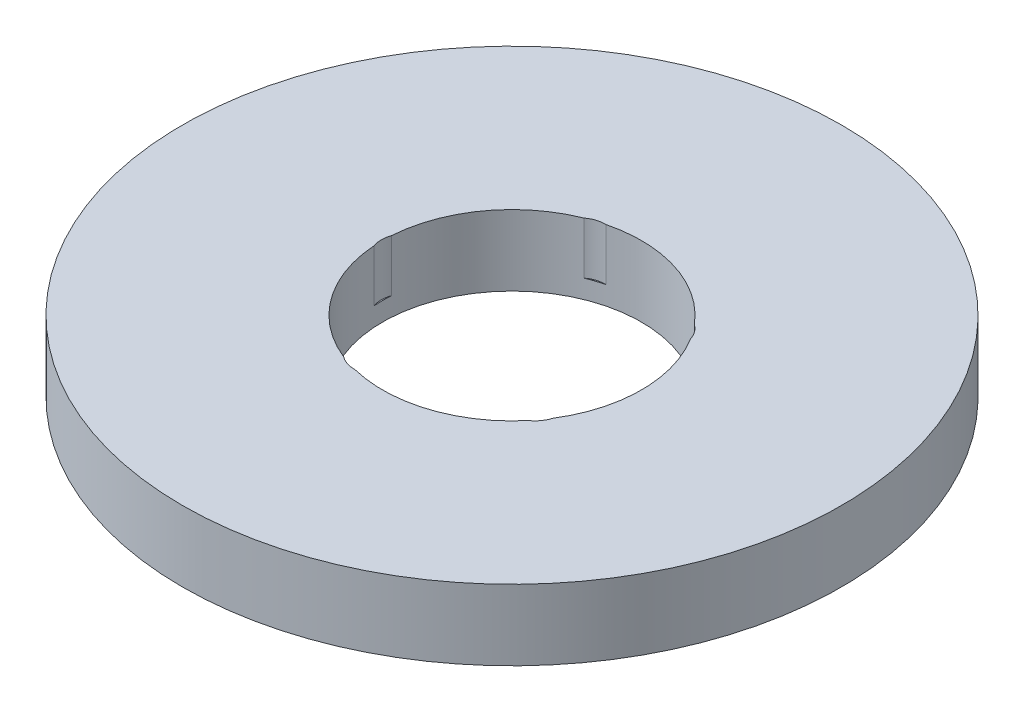
ISO-10303-21;
HEADER;
FILE_DESCRIPTION(('STEP AP214'),'2;1');
FILE_NAME('part.step','',(''),(''),'','','');
FILE_SCHEMA(('AUTOMOTIVE_DESIGN { 1 0 10303 214 1 1 1 1 }'));
ENDSEC;
DATA;
#1=APPLICATION_CONTEXT('core data for automotive mechanical design processes');
#2=APPLICATION_PROTOCOL_DEFINITION('international standard','automotive_design',2000,#1);
#3=PRODUCT_CONTEXT('',#1,'mechanical');
#4=PRODUCT('Part','Part','',(#3));
#5=PRODUCT_RELATED_PRODUCT_CATEGORY('part','',(#4));
#6=PRODUCT_DEFINITION_FORMATION('','',#4);
#7=PRODUCT_DEFINITION_CONTEXT('part definition',#1,'design');
#8=PRODUCT_DEFINITION('design','',#6,#7);
#9=PRODUCT_DEFINITION_SHAPE('','',#8);
#10=(LENGTH_UNIT() NAMED_UNIT(*) SI_UNIT(.MILLI.,.METRE.));
#11=(NAMED_UNIT(*) PLANE_ANGLE_UNIT() SI_UNIT($,.RADIAN.));
#12=(NAMED_UNIT(*) SI_UNIT($,.STERADIAN.) SOLID_ANGLE_UNIT());
#13=UNCERTAINTY_MEASURE_WITH_UNIT(LENGTH_MEASURE(1.E-05),#10,'distance_accuracy_value','');
#14=(GEOMETRIC_REPRESENTATION_CONTEXT(3) GLOBAL_UNCERTAINTY_ASSIGNED_CONTEXT((#13)) GLOBAL_UNIT_ASSIGNED_CONTEXT((#10,
#11,#12)) REPRESENTATION_CONTEXT('',''));
#15=CARTESIAN_POINT('',(0.,0.,0.));
#16=DIRECTION('',(0.,0.,1.));
#17=DIRECTION('',(1.,0.,0.));
#18=AXIS2_PLACEMENT_3D('',#15,#16,#17);
#19=CARTESIAN_POINT('',(0.,15.,0.));
#20=DIRECTION('',(0.,-1.,0.));
#21=DIRECTION('',(0.,0.,-1.));
#22=AXIS2_PLACEMENT_3D('',#19,#20,#21);
#23=CYLINDRICAL_SURFACE('',#22,70.);
#24=CARTESIAN_POINT('',(0.,15.,0.));
#25=DIRECTION('',(0.,1.,0.));
#26=DIRECTION('',(0.,0.,1.));
#27=AXIS2_PLACEMENT_3D('',#24,#25,#26);
#28=CIRCLE('',#27,70.);
#29=CARTESIAN_POINT('',(0.,15.,70.));
#30=VERTEX_POINT('',#29);
#31=EDGE_CURVE('E151',#30,#30,#28,.T.);
#32=ORIENTED_EDGE('',*,*,#31,.F.);
#33=EDGE_LOOP('',(#32));
#34=FACE_BOUND('',#33,.T.);
#35=CARTESIAN_POINT('',(0.,0.,0.));
#36=DIRECTION('',(0.,1.,0.));
#37=DIRECTION('',(0.,0.,1.));
#38=AXIS2_PLACEMENT_3D('',#35,#36,#37);
#39=CIRCLE('',#38,70.);
#40=CARTESIAN_POINT('',(0.,0.,70.));
#41=VERTEX_POINT('',#40);
#42=EDGE_CURVE('E150',#41,#41,#39,.T.);
#43=ORIENTED_EDGE('',*,*,#42,.T.);
#44=EDGE_LOOP('',(#43));
#45=FACE_BOUND('',#44,.T.);
#46=ADVANCED_FACE('F39',(#34,#45),#23,.T.);
#47=CARTESIAN_POINT('',(0.,15.,0.));
#48=DIRECTION('',(0.,1.,0.));
#49=DIRECTION('',(0.,0.,1.));
#50=AXIS2_PLACEMENT_3D('',#47,#48,#49);
#51=PLANE('',#50);
#52=CARTESIAN_POINT('',(-6.83301555641403,15.,-21.029859487237));
#53=DIRECTION('',(0.,1.,0.));
#54=DIRECTION('',(-0.95105651629515,0.,0.309016994374958));
#55=AXIS2_PLACEMENT_3D('',#52,#53,#54);
#56=CIRCLE('',#55,5.64270713530895);
#57=CARTESIAN_POINT('',(-6.70121698633147,15.,-26.6710271812336));
#58=VERTEX_POINT('',#57);
#59=CARTESIAN_POINT('',(-10.2554380156852,15.,-25.5161907640314));
#60=VERTEX_POINT('',#59);
#61=EDGE_CURVE('E196',#58,#60,#56,.T.);
#62=ORIENTED_EDGE('',*,*,#61,.F.);
#63=CARTESIAN_POINT('',(0.,15.,0.));
#64=DIRECTION('',(0.,1.,0.));
#65=DIRECTION('',(0.,0.,1.));
#66=AXIS2_PLACEMENT_3D('',#63,#64,#65);
#67=CIRCLE('',#66,27.5);
#68=CARTESIAN_POINT('',(21.0982348655567,15.,-17.6384377300771));
#69=VERTEX_POINT('',#68);
#70=EDGE_CURVE('E156',#69,#58,#67,.T.);
#71=ORIENTED_EDGE('',*,*,#70,.F.);
#72=CARTESIAN_POINT('',(17.889066972348,15.,-12.9971679417471));
#73=DIRECTION('',(0.,1.,0.));
#74=DIRECTION('',(-0.58778525229248,0.,-0.809016994374942));
#75=AXIS2_PLACEMENT_3D('',#72,#73,#74);
#76=CIRCLE('',#75,5.64270713530895);
#77=CARTESIAN_POINT('',(23.2948642652269,15.,-14.6150367383956));
#78=VERTEX_POINT('',#77);
#79=EDGE_CURVE('E254',#78,#69,#76,.T.);
#80=ORIENTED_EDGE('',*,*,#79,.F.);
#81=CARTESIAN_POINT('',(23.2948642652272,15.,14.6150367383952));
#82=VERTEX_POINT('',#81);
#83=EDGE_CURVE('E153',#82,#78,#67,.T.);
#84=ORIENTED_EDGE('',*,*,#83,.F.);
#85=CARTESIAN_POINT('',(17.8890669723482,15.,12.9971679417469));
#86=DIRECTION('',(0.,1.,0.));
#87=DIRECTION('',(0.587785252292469,0.,-0.809016994374951));
#88=AXIS2_PLACEMENT_3D('',#85,#86,#87);
#89=CIRCLE('',#88,5.64270713530895);
#90=CARTESIAN_POINT('',(21.0982348655569,15.,17.6384377300768));
#91=VERTEX_POINT('',#90);
#92=EDGE_CURVE('E248',#91,#82,#89,.T.);
#93=ORIENTED_EDGE('',*,*,#92,.F.);
#94=CARTESIAN_POINT('',(-6.70121698633107,15.,26.6710271812337));
#95=VERTEX_POINT('',#94);
#96=EDGE_CURVE('E140',#95,#91,#67,.T.);
#97=ORIENTED_EDGE('',*,*,#96,.F.);
#98=CARTESIAN_POINT('',(-6.83301555641373,15.,21.0298594872371));
#99=DIRECTION('',(0.,1.,0.));
#100=DIRECTION('',(0.951056516295155,0.,0.309016994374945));
#101=AXIS2_PLACEMENT_3D('',#98,#99,#100);
#102=CIRCLE('',#101,5.64270713530895);
#103=CARTESIAN_POINT('',(-10.2554380156848,15.,25.5161907640315));
#104=VERTEX_POINT('',#103);
#105=EDGE_CURVE('E117',#104,#95,#102,.T.);
#106=ORIENTED_EDGE('',*,*,#105,.F.);
#107=CARTESIAN_POINT('',(-27.4364441287679,15.,1.86856457447934));
#108=VERTEX_POINT('',#107);
#109=EDGE_CURVE('E133',#108,#104,#67,.T.);
#110=ORIENTED_EDGE('',*,*,#109,.F.);
#111=CARTESIAN_POINT('',(-22.1121028318686,15.,0.));
#112=DIRECTION('',(0.,1.,0.));
#113=DIRECTION('',(0.,0.,1.));
#114=AXIS2_PLACEMENT_3D('',#111,#112,#113);
#115=CIRCLE('',#114,5.64270713530895);
#116=CARTESIAN_POINT('',(-27.4364441287679,15.,-1.86856457447934));
#117=VERTEX_POINT('',#116);
#118=EDGE_CURVE('E170',#117,#108,#115,.T.);
#119=ORIENTED_EDGE('',*,*,#118,.F.);
#120=EDGE_CURVE('E149',#60,#117,#67,.T.);
#121=ORIENTED_EDGE('',*,*,#120,.F.);
#122=EDGE_LOOP('',(#62,#71,#80,#84,#93,#97,#106,#110,#119,#121));
#123=FACE_BOUND('',#122,.T.);
#124=ORIENTED_EDGE('',*,*,#31,.T.);
#125=EDGE_LOOP('',(#124));
#126=FACE_BOUND('',#125,.T.);
#127=ADVANCED_FACE('F131',(#123,#126),#51,.T.);
#128=CARTESIAN_POINT('',(0.,0.,0.));
#129=DIRECTION('',(0.,1.,0.));
#130=DIRECTION('',(0.,0.,1.));
#131=AXIS2_PLACEMENT_3D('',#128,#129,#130);
#132=PLANE('',#131);
#133=CARTESIAN_POINT('',(0.,0.,0.));
#134=DIRECTION('',(0.,1.,0.));
#135=DIRECTION('',(0.,0.,1.));
#136=AXIS2_PLACEMENT_3D('',#133,#134,#135);
#137=CIRCLE('',#136,27.5);
#138=CARTESIAN_POINT('',(0.,0.,27.5));
#139=VERTEX_POINT('',#138);
#140=EDGE_CURVE('E160',#139,#139,#137,.T.);
#141=ORIENTED_EDGE('',*,*,#140,.T.);
#142=EDGE_LOOP('',(#141));
#143=FACE_BOUND('',#142,.T.);
#144=ORIENTED_EDGE('',*,*,#42,.F.);
#145=EDGE_LOOP('',(#144));
#146=FACE_BOUND('',#145,.T.);
#147=ADVANCED_FACE('F212',(#143,#146),#132,.F.);
#148=CARTESIAN_POINT('',(0.,15.,0.));
#149=DIRECTION('',(0.,-1.,0.));
#150=DIRECTION('',(0.,0.,-1.));
#151=AXIS2_PLACEMENT_3D('',#148,#149,#150);
#152=CYLINDRICAL_SURFACE('',#151,27.5);
#153=DIRECTION('',(0.,1.,0.));
#154=VECTOR('',#153,1.);
#155=CARTESIAN_POINT('',(-6.70121698633148,9.47573850762841,-26.6710271812336));
#156=LINE('',#155,#154);
#157=CARTESIAN_POINT('',(-6.70121698633147,3.95147701525682,-26.6710271812336));
#158=VERTEX_POINT('',#157);
#159=EDGE_CURVE('E11',#158,#58,#156,.T.);
#160=ORIENTED_EDGE('',*,*,#159,.F.);
#161=CARTESIAN_POINT('',(0.,3.95147701525682,0.));
#162=DIRECTION('',(0.,1.,0.));
#163=DIRECTION('',(0.,0.,1.));
#164=AXIS2_PLACEMENT_3D('',#161,#162,#163);
#165=CIRCLE('',#164,27.5);
#166=CARTESIAN_POINT('',(-10.2554380156852,3.95147701525682,-25.5161907640314));
#167=VERTEX_POINT('',#166);
#168=EDGE_CURVE('E193',#158,#167,#165,.T.);
#169=ORIENTED_EDGE('',*,*,#168,.T.);
#170=DIRECTION('',(0.,1.,0.));
#171=VECTOR('',#170,1.);
#172=CARTESIAN_POINT('',(-10.2554380156852,9.47573850762841,-25.5161907640314));
#173=LINE('',#172,#171);
#174=EDGE_CURVE('E46',#60,#167,#173,.F.);
#175=ORIENTED_EDGE('',*,*,#174,.F.);
#176=ORIENTED_EDGE('',*,*,#120,.T.);
#177=DIRECTION('',(0.,1.,0.));
#178=VECTOR('',#177,1.);
#179=CARTESIAN_POINT('',(-27.4364441287679,9.47573850762841,-1.86856457447932));
#180=LINE('',#179,#178);
#181=CARTESIAN_POINT('',(-27.4364441287679,3.95147701525682,-1.86856457447934));
#182=VERTEX_POINT('',#181);
#183=EDGE_CURVE('E174',#182,#117,#180,.T.);
#184=ORIENTED_EDGE('',*,*,#183,.F.);
#185=CARTESIAN_POINT('',(0.,3.95147701525682,0.));
#186=DIRECTION('',(0.,1.,0.));
#187=DIRECTION('',(0.,0.,1.));
#188=AXIS2_PLACEMENT_3D('',#185,#186,#187);
#189=CIRCLE('',#188,27.5);
#190=CARTESIAN_POINT('',(-27.4364441287679,3.95147701525682,1.86856457447934));
#191=VERTEX_POINT('',#190);
#192=EDGE_CURVE('E171',#182,#191,#189,.T.);
#193=ORIENTED_EDGE('',*,*,#192,.T.);
#194=DIRECTION('',(0.,1.,0.));
#195=VECTOR('',#194,1.);
#196=CARTESIAN_POINT('',(-27.4364441287679,9.47573850762841,1.86856457447932));
#197=LINE('',#196,#195);
#198=EDGE_CURVE('E148',#108,#191,#197,.F.);
#199=ORIENTED_EDGE('',*,*,#198,.F.);
#200=ORIENTED_EDGE('',*,*,#109,.T.);
#201=DIRECTION('',(0.,1.,0.));
#202=VECTOR('',#201,1.);
#203=CARTESIAN_POINT('',(-10.2554380156848,9.47573850762841,25.5161907640315));
#204=LINE('',#203,#202);
#205=CARTESIAN_POINT('',(-10.2554380156848,3.95147701525682,25.5161907640315));
#206=VERTEX_POINT('',#205);
#207=EDGE_CURVE('E111',#206,#104,#204,.T.);
#208=ORIENTED_EDGE('',*,*,#207,.F.);
#209=CARTESIAN_POINT('',(0.,3.95147701525682,0.));
#210=DIRECTION('',(0.,1.,0.));
#211=DIRECTION('',(0.,0.,1.));
#212=AXIS2_PLACEMENT_3D('',#209,#210,#211);
#213=CIRCLE('',#212,27.5);
#214=CARTESIAN_POINT('',(-6.70121698633107,3.95147701525682,26.6710271812337));
#215=VERTEX_POINT('',#214);
#216=EDGE_CURVE('E180',#206,#215,#213,.T.);
#217=ORIENTED_EDGE('',*,*,#216,.T.);
#218=DIRECTION('',(0.,1.,0.));
#219=VECTOR('',#218,1.);
#220=CARTESIAN_POINT('',(-6.7012169863311,9.47573850762841,26.6710271812337));
#221=LINE('',#220,#219);
#222=EDGE_CURVE('E124',#95,#215,#221,.F.);
#223=ORIENTED_EDGE('',*,*,#222,.F.);
#224=ORIENTED_EDGE('',*,*,#96,.T.);
#225=DIRECTION('',(0.,1.,0.));
#226=VECTOR('',#225,1.);
#227=CARTESIAN_POINT('',(21.098234865557,9.47573850762841,17.6384377300768));
#228=LINE('',#227,#226);
#229=CARTESIAN_POINT('',(21.0982348655569,3.95147701525682,17.6384377300768));
#230=VERTEX_POINT('',#229);
#231=EDGE_CURVE('E183',#230,#91,#228,.T.);
#232=ORIENTED_EDGE('',*,*,#231,.F.);
#233=CARTESIAN_POINT('',(0.,3.95147701525682,0.));
#234=DIRECTION('',(0.,1.,0.));
#235=DIRECTION('',(0.,0.,1.));
#236=AXIS2_PLACEMENT_3D('',#233,#234,#235);
#237=CIRCLE('',#236,27.5);
#238=CARTESIAN_POINT('',(23.2948642652272,3.95147701525682,14.6150367383952));
#239=VERTEX_POINT('',#238);
#240=EDGE_CURVE('E123',#230,#239,#237,.T.);
#241=ORIENTED_EDGE('',*,*,#240,.T.);
#242=DIRECTION('',(0.,1.,0.));
#243=VECTOR('',#242,1.);
#244=CARTESIAN_POINT('',(23.2948642652272,9.47573850762841,14.6150367383953));
#245=LINE('',#244,#243);
#246=EDGE_CURVE('E185',#82,#239,#245,.F.);
#247=ORIENTED_EDGE('',*,*,#246,.F.);
#248=ORIENTED_EDGE('',*,*,#83,.T.);
#249=DIRECTION('',(0.,1.,0.));
#250=VECTOR('',#249,1.);
#251=CARTESIAN_POINT('',(23.2948642652269,9.47573850762841,-14.6150367383956));
#252=LINE('',#251,#250);
#253=CARTESIAN_POINT('',(23.2948642652269,3.95147701525682,-14.6150367383956));
#254=VERTEX_POINT('',#253);
#255=EDGE_CURVE('E195',#254,#78,#252,.T.);
#256=ORIENTED_EDGE('',*,*,#255,.F.);
#257=CARTESIAN_POINT('',(0.,3.95147701525682,0.));
#258=DIRECTION('',(0.,1.,0.));
#259=DIRECTION('',(0.,0.,1.));
#260=AXIS2_PLACEMENT_3D('',#257,#258,#259);
#261=CIRCLE('',#260,27.5);
#262=CARTESIAN_POINT('',(21.0982348655567,3.95147701525682,-17.6384377300771));
#263=VERTEX_POINT('',#262);
#264=EDGE_CURVE('E190',#254,#263,#261,.T.);
#265=ORIENTED_EDGE('',*,*,#264,.T.);
#266=DIRECTION('',(0.,1.,0.));
#267=VECTOR('',#266,1.);
#268=CARTESIAN_POINT('',(21.0982348655567,9.47573850762841,-17.6384377300771));
#269=LINE('',#268,#267);
#270=EDGE_CURVE('E189',#69,#263,#269,.F.);
#271=ORIENTED_EDGE('',*,*,#270,.F.);
#272=ORIENTED_EDGE('',*,*,#70,.T.);
#273=EDGE_LOOP('',(#160,#169,#175,#176,#184,#193,#199,#200,#208,#217,#223,#224,#232,#241,#247,
#248,#256,#265,#271,#272));
#274=FACE_BOUND('',#273,.T.);
#275=ORIENTED_EDGE('',*,*,#140,.F.);
#276=EDGE_LOOP('',(#275));
#277=FACE_BOUND('',#276,.T.);
#278=ADVANCED_FACE('F142',(#274,#277),#152,.F.);
#279=CARTESIAN_POINT('',(-22.1121028318686,3.95147701525682,0.));
#280=DIRECTION('',(0.,1.,0.));
#281=DIRECTION('',(0.,0.,1.));
#282=AXIS2_PLACEMENT_3D('',#279,#280,#281);
#283=CYLINDRICAL_SURFACE('',#282,5.64270713530895);
#284=ORIENTED_EDGE('',*,*,#183,.T.);
#285=ORIENTED_EDGE('',*,*,#118,.T.);
#286=ORIENTED_EDGE('',*,*,#198,.T.);
#287=CARTESIAN_POINT('',(-22.1121028318686,3.95147701525682,0.));
#288=DIRECTION('',(0.,1.,0.));
#289=DIRECTION('',(0.,0.,1.));
#290=AXIS2_PLACEMENT_3D('',#287,#288,#289);
#291=CIRCLE('',#290,5.64270713530895);
#292=EDGE_CURVE('E163',#182,#191,#291,.T.);
#293=ORIENTED_EDGE('',*,*,#292,.F.);
#294=EDGE_LOOP('',(#284,#285,#286,#293));
#295=FACE_BOUND('',#294,.T.);
#296=ADVANCED_FACE('F221',(#295),#283,.F.);
#297=CARTESIAN_POINT('',(-22.1121028318686,3.95147701525682,0.));
#298=DIRECTION('',(0.,1.,0.));
#299=DIRECTION('',(0.,0.,1.));
#300=AXIS2_PLACEMENT_3D('',#297,#298,#299);
#301=PLANE('',#300);
#302=ORIENTED_EDGE('',*,*,#292,.T.);
#303=ORIENTED_EDGE('',*,*,#192,.F.);
#304=EDGE_LOOP('',(#302,#303));
#305=FACE_BOUND('',#304,.T.);
#306=ADVANCED_FACE('F227',(#305),#301,.T.);
#307=CARTESIAN_POINT('',(-6.83301555641373,3.95147701525682,21.0298594872371));
#308=DIRECTION('',(0.,1.,0.));
#309=DIRECTION('',(0.,0.,1.));
#310=AXIS2_PLACEMENT_3D('',#307,#308,#309);
#311=CYLINDRICAL_SURFACE('',#310,5.64270713530895);
#312=ORIENTED_EDGE('',*,*,#207,.T.);
#313=ORIENTED_EDGE('',*,*,#105,.T.);
#314=ORIENTED_EDGE('',*,*,#222,.T.);
#315=CARTESIAN_POINT('',(-6.83301555641373,3.95147701525682,21.0298594872371));
#316=DIRECTION('',(0.,1.,0.));
#317=DIRECTION('',(0.951056516295155,0.,0.309016994374945));
#318=AXIS2_PLACEMENT_3D('',#315,#316,#317);
#319=CIRCLE('',#318,5.64270713530895);
#320=EDGE_CURVE('E119',#206,#215,#319,.T.);
#321=ORIENTED_EDGE('',*,*,#320,.F.);
#322=EDGE_LOOP('',(#312,#313,#314,#321));
#323=FACE_BOUND('',#322,.T.);
#324=ADVANCED_FACE('F116',(#323),#311,.F.);
#325=CARTESIAN_POINT('',(-6.83301555641373,3.95147701525682,21.0298594872371));
#326=DIRECTION('',(0.,1.,0.));
#327=DIRECTION('',(0.951056516295155,0.,0.309016994374945));
#328=AXIS2_PLACEMENT_3D('',#325,#326,#327);
#329=PLANE('',#328);
#330=ORIENTED_EDGE('',*,*,#320,.T.);
#331=ORIENTED_EDGE('',*,*,#216,.F.);
#332=EDGE_LOOP('',(#330,#331));
#333=FACE_BOUND('',#332,.T.);
#334=ADVANCED_FACE('F234',(#333),#329,.T.);
#335=CARTESIAN_POINT('',(17.8890669723482,3.95147701525682,12.9971679417469));
#336=DIRECTION('',(0.,1.,0.));
#337=DIRECTION('',(0.,0.,1.));
#338=AXIS2_PLACEMENT_3D('',#335,#336,#337);
#339=CYLINDRICAL_SURFACE('',#338,5.64270713530895);
#340=ORIENTED_EDGE('',*,*,#231,.T.);
#341=ORIENTED_EDGE('',*,*,#92,.T.);
#342=ORIENTED_EDGE('',*,*,#246,.T.);
#343=CARTESIAN_POINT('',(17.8890669723482,3.95147701525682,12.9971679417469));
#344=DIRECTION('',(0.,1.,0.));
#345=DIRECTION('',(0.587785252292469,0.,-0.809016994374951));
#346=AXIS2_PLACEMENT_3D('',#343,#344,#345);
#347=CIRCLE('',#346,5.64270713530895);
#348=EDGE_CURVE('E137',#230,#239,#347,.T.);
#349=ORIENTED_EDGE('',*,*,#348,.F.);
#350=EDGE_LOOP('',(#340,#341,#342,#349));
#351=FACE_BOUND('',#350,.T.);
#352=ADVANCED_FACE('F240',(#351),#339,.F.);
#353=CARTESIAN_POINT('',(17.8890669723482,3.95147701525682,12.9971679417469));
#354=DIRECTION('',(0.,1.,0.));
#355=DIRECTION('',(0.587785252292469,0.,-0.809016994374951));
#356=AXIS2_PLACEMENT_3D('',#353,#354,#355);
#357=PLANE('',#356);
#358=ORIENTED_EDGE('',*,*,#348,.T.);
#359=ORIENTED_EDGE('',*,*,#240,.F.);
#360=EDGE_LOOP('',(#358,#359));
#361=FACE_BOUND('',#360,.T.);
#362=ADVANCED_FACE('F245',(#361),#357,.T.);
#363=CARTESIAN_POINT('',(17.889066972348,3.95147701525682,-12.9971679417471));
#364=DIRECTION('',(0.,1.,0.));
#365=DIRECTION('',(0.,0.,1.));
#366=AXIS2_PLACEMENT_3D('',#363,#364,#365);
#367=CYLINDRICAL_SURFACE('',#366,5.64270713530895);
#368=ORIENTED_EDGE('',*,*,#255,.T.);
#369=ORIENTED_EDGE('',*,*,#79,.T.);
#370=ORIENTED_EDGE('',*,*,#270,.T.);
#371=CARTESIAN_POINT('',(17.889066972348,3.95147701525682,-12.9971679417471));
#372=DIRECTION('',(0.,1.,0.));
#373=DIRECTION('',(-0.58778525229248,0.,-0.809016994374942));
#374=AXIS2_PLACEMENT_3D('',#371,#372,#373);
#375=CIRCLE('',#374,5.64270713530895);
#376=EDGE_CURVE('E56',#254,#263,#375,.T.);
#377=ORIENTED_EDGE('',*,*,#376,.F.);
#378=EDGE_LOOP('',(#368,#369,#370,#377));
#379=FACE_BOUND('',#378,.T.);
#380=ADVANCED_FACE('F264',(#379),#367,.F.);
#381=CARTESIAN_POINT('',(17.889066972348,3.95147701525682,-12.9971679417471));
#382=DIRECTION('',(0.,1.,0.));
#383=DIRECTION('',(-0.58778525229248,0.,-0.809016994374942));
#384=AXIS2_PLACEMENT_3D('',#381,#382,#383);
#385=PLANE('',#384);
#386=ORIENTED_EDGE('',*,*,#376,.T.);
#387=ORIENTED_EDGE('',*,*,#264,.F.);
#388=EDGE_LOOP('',(#386,#387));
#389=FACE_BOUND('',#388,.T.);
#390=ADVANCED_FACE('F202',(#389),#385,.T.);
#391=CARTESIAN_POINT('',(-6.83301555641403,3.95147701525682,-21.029859487237));
#392=DIRECTION('',(0.,1.,0.));
#393=DIRECTION('',(0.,0.,1.));
#394=AXIS2_PLACEMENT_3D('',#391,#392,#393);
#395=CYLINDRICAL_SURFACE('',#394,5.64270713530895);
#396=ORIENTED_EDGE('',*,*,#159,.T.);
#397=ORIENTED_EDGE('',*,*,#61,.T.);
#398=ORIENTED_EDGE('',*,*,#174,.T.);
#399=CARTESIAN_POINT('',(-6.83301555641403,3.95147701525682,-21.029859487237));
#400=DIRECTION('',(0.,1.,0.));
#401=DIRECTION('',(-0.95105651629515,0.,0.309016994374958));
#402=AXIS2_PLACEMENT_3D('',#399,#400,#401);
#403=CIRCLE('',#402,5.64270713530895);
#404=EDGE_CURVE('E55',#158,#167,#403,.T.);
#405=ORIENTED_EDGE('',*,*,#404,.F.);
#406=EDGE_LOOP('',(#396,#397,#398,#405));
#407=FACE_BOUND('',#406,.T.);
#408=ADVANCED_FACE('F197',(#407),#395,.F.);
#409=CARTESIAN_POINT('',(-6.83301555641403,3.95147701525682,-21.029859487237));
#410=DIRECTION('',(0.,1.,0.));
#411=DIRECTION('',(-0.95105651629515,0.,0.309016994374958));
#412=AXIS2_PLACEMENT_3D('',#409,#410,#411);
#413=PLANE('',#412);
#414=ORIENTED_EDGE('',*,*,#404,.T.);
#415=ORIENTED_EDGE('',*,*,#168,.F.);
#416=EDGE_LOOP('',(#414,#415));
#417=FACE_BOUND('',#416,.T.);
#418=ADVANCED_FACE('F200',(#417),#413,.T.);
#419=CLOSED_SHELL('',(#46,#127,#147,#278,#296,#306,#324,#334,#352,#362,#380,#390,#408,#418));
#420=MANIFOLD_SOLID_BREP('B2',#419);
#421=ADVANCED_BREP_SHAPE_REPRESENTATION('',(#18,#420),#14);
#422=SHAPE_DEFINITION_REPRESENTATION(#9,#421);
ENDSEC;
END-ISO-10303-21;
